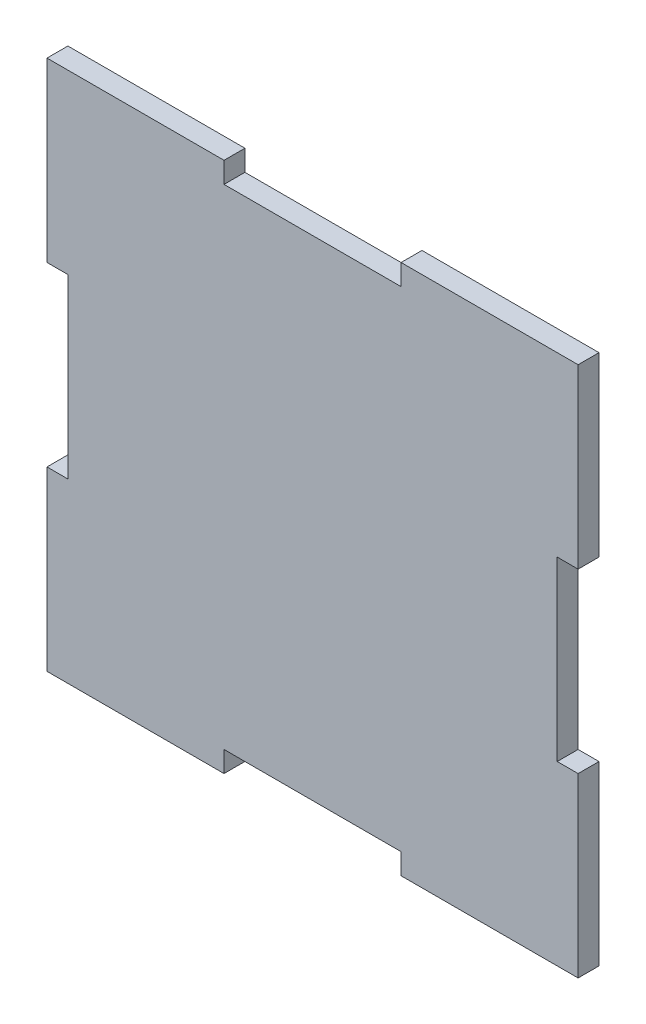
ISO-10303-21;
HEADER;
FILE_DESCRIPTION(('STEP AP214'),'2;1');
FILE_NAME('part.step','',(''),(''),'','','');
FILE_SCHEMA(('AUTOMOTIVE_DESIGN { 1 0 10303 214 1 1 1 1 }'));
ENDSEC;
DATA;
#1=APPLICATION_CONTEXT('core data for automotive mechanical design processes');
#2=APPLICATION_PROTOCOL_DEFINITION('international standard','automotive_design',2000,#1);
#3=PRODUCT_CONTEXT('',#1,'mechanical');
#4=PRODUCT('Part','Part','',(#3));
#5=PRODUCT_RELATED_PRODUCT_CATEGORY('part','',(#4));
#6=PRODUCT_DEFINITION_FORMATION('','',#4);
#7=PRODUCT_DEFINITION_CONTEXT('part definition',#1,'design');
#8=PRODUCT_DEFINITION('design','',#6,#7);
#9=PRODUCT_DEFINITION_SHAPE('','',#8);
#10=(LENGTH_UNIT() NAMED_UNIT(*) SI_UNIT(.MILLI.,.METRE.));
#11=(NAMED_UNIT(*) PLANE_ANGLE_UNIT() SI_UNIT($,.RADIAN.));
#12=(NAMED_UNIT(*) SI_UNIT($,.STERADIAN.) SOLID_ANGLE_UNIT());
#13=UNCERTAINTY_MEASURE_WITH_UNIT(LENGTH_MEASURE(1.E-05),#10,'distance_accuracy_value','');
#14=(GEOMETRIC_REPRESENTATION_CONTEXT(3) GLOBAL_UNCERTAINTY_ASSIGNED_CONTEXT((#13)) GLOBAL_UNIT_ASSIGNED_CONTEXT((#10,
#11,#12)) REPRESENTATION_CONTEXT('',''));
#15=CARTESIAN_POINT('',(0.,0.,0.));
#16=DIRECTION('',(0.,0.,1.));
#17=DIRECTION('',(1.,0.,0.));
#18=AXIS2_PLACEMENT_3D('',#15,#16,#17);
#19=CARTESIAN_POINT('',(0.,0.,2.9972));
#20=DIRECTION('',(1.,0.,0.));
#21=DIRECTION('',(0.,0.,-1.));
#22=AXIS2_PLACEMENT_3D('',#19,#20,#21);
#23=PLANE('',#22);
#24=DIRECTION('',(0.,-1.,0.));
#25=VECTOR('',#24,1.);
#26=CARTESIAN_POINT('',(0.,0.,0.));
#27=LINE('',#26,#25);
#28=CARTESIAN_POINT('',(0.,25.4,0.));
#29=VERTEX_POINT('',#28);
#30=CARTESIAN_POINT('',(0.,0.,0.));
#31=VERTEX_POINT('',#30);
#32=EDGE_CURVE('E201',#29,#31,#27,.T.);
#33=ORIENTED_EDGE('',*,*,#32,.T.);
#34=DIRECTION('',(0.,0.,-1.));
#35=VECTOR('',#34,1.);
#36=CARTESIAN_POINT('',(0.,0.,2.9972));
#37=LINE('',#36,#35);
#38=CARTESIAN_POINT('',(0.,0.,2.9972));
#39=VERTEX_POINT('',#38);
#40=EDGE_CURVE('E11',#39,#31,#37,.T.);
#41=ORIENTED_EDGE('',*,*,#40,.F.);
#42=DIRECTION('',(0.,-1.,0.));
#43=VECTOR('',#42,1.);
#44=CARTESIAN_POINT('',(0.,0.,2.9972));
#45=LINE('',#44,#43);
#46=CARTESIAN_POINT('',(0.,25.4,2.9972));
#47=VERTEX_POINT('',#46);
#48=EDGE_CURVE('E239',#47,#39,#45,.T.);
#49=ORIENTED_EDGE('',*,*,#48,.F.);
#50=DIRECTION('',(0.,0.,-1.));
#51=VECTOR('',#50,1.);
#52=CARTESIAN_POINT('',(0.,25.4,2.9972));
#53=LINE('',#52,#51);
#54=EDGE_CURVE('E197',#47,#29,#53,.T.);
#55=ORIENTED_EDGE('',*,*,#54,.T.);
#56=EDGE_LOOP('',(#33,#41,#49,#55));
#57=FACE_BOUND('',#56,.T.);
#58=ADVANCED_FACE('F33',(#57),#23,.F.);
#59=CARTESIAN_POINT('',(0.,0.,2.9972));
#60=DIRECTION('',(0.,1.,0.));
#61=DIRECTION('',(0.,0.,1.));
#62=AXIS2_PLACEMENT_3D('',#59,#60,#61);
#63=PLANE('',#62);
#64=DIRECTION('',(1.,0.,0.));
#65=VECTOR('',#64,1.);
#66=CARTESIAN_POINT('',(0.,0.,0.));
#67=LINE('',#66,#65);
#68=CARTESIAN_POINT('',(25.4,0.,0.));
#69=VERTEX_POINT('',#68);
#70=EDGE_CURVE('E204',#31,#69,#67,.T.);
#71=ORIENTED_EDGE('',*,*,#70,.T.);
#72=DIRECTION('',(0.,0.,-1.));
#73=VECTOR('',#72,1.);
#74=CARTESIAN_POINT('',(25.4,0.,2.9972));
#75=LINE('',#74,#73);
#76=CARTESIAN_POINT('',(25.4,0.,2.9972));
#77=VERTEX_POINT('',#76);
#78=EDGE_CURVE('E41',#77,#69,#75,.T.);
#79=ORIENTED_EDGE('',*,*,#78,.F.);
#80=DIRECTION('',(1.,0.,0.));
#81=VECTOR('',#80,1.);
#82=CARTESIAN_POINT('',(0.,0.,2.9972));
#83=LINE('',#82,#81);
#84=EDGE_CURVE('E128',#39,#77,#83,.T.);
#85=ORIENTED_EDGE('',*,*,#84,.F.);
#86=ORIENTED_EDGE('',*,*,#40,.T.);
#87=EDGE_LOOP('',(#71,#79,#85,#86));
#88=FACE_BOUND('',#87,.T.);
#89=ADVANCED_FACE('F357',(#88),#63,.F.);
#90=CARTESIAN_POINT('',(25.4,0.,2.9972));
#91=DIRECTION('',(-1.,0.,0.));
#92=DIRECTION('',(0.,0.,1.));
#93=AXIS2_PLACEMENT_3D('',#90,#91,#92);
#94=PLANE('',#93);
#95=DIRECTION('',(0.,1.,0.));
#96=VECTOR('',#95,1.);
#97=CARTESIAN_POINT('',(25.4,0.,0.));
#98=LINE('',#97,#96);
#99=CARTESIAN_POINT('',(25.4,2.9972,0.));
#100=VERTEX_POINT('',#99);
#101=EDGE_CURVE('E206',#69,#100,#98,.T.);
#102=ORIENTED_EDGE('',*,*,#101,.T.);
#103=DIRECTION('',(0.,0.,-1.));
#104=VECTOR('',#103,1.);
#105=CARTESIAN_POINT('',(25.4,2.9972,2.9972));
#106=LINE('',#105,#104);
#107=CARTESIAN_POINT('',(25.4,2.9972,2.9972));
#108=VERTEX_POINT('',#107);
#109=EDGE_CURVE('E282',#108,#100,#106,.T.);
#110=ORIENTED_EDGE('',*,*,#109,.F.);
#111=DIRECTION('',(0.,1.,0.));
#112=VECTOR('',#111,1.);
#113=CARTESIAN_POINT('',(25.4,0.,2.9972));
#114=LINE('',#113,#112);
#115=EDGE_CURVE('E290',#77,#108,#114,.T.);
#116=ORIENTED_EDGE('',*,*,#115,.F.);
#117=ORIENTED_EDGE('',*,*,#78,.T.);
#118=EDGE_LOOP('',(#102,#110,#116,#117));
#119=FACE_BOUND('',#118,.T.);
#120=ADVANCED_FACE('F288',(#119),#94,.F.);
#121=CARTESIAN_POINT('',(50.8,2.9972,2.9972));
#122=DIRECTION('',(0.,1.,0.));
#123=DIRECTION('',(-1.,0.,0.));
#124=AXIS2_PLACEMENT_3D('',#121,#122,#123);
#125=PLANE('',#124);
#126=DIRECTION('',(1.,0.,0.));
#127=VECTOR('',#126,1.);
#128=CARTESIAN_POINT('',(50.8,2.9972,0.));
#129=LINE('',#128,#127);
#130=CARTESIAN_POINT('',(50.8,2.9972,0.));
#131=VERTEX_POINT('',#130);
#132=EDGE_CURVE('E208',#100,#131,#129,.T.);
#133=ORIENTED_EDGE('',*,*,#132,.T.);
#134=DIRECTION('',(0.,0.,-1.));
#135=VECTOR('',#134,1.);
#136=CARTESIAN_POINT('',(50.8,2.9972,2.9972));
#137=LINE('',#136,#135);
#138=CARTESIAN_POINT('',(50.8,2.9972,2.9972));
#139=VERTEX_POINT('',#138);
#140=EDGE_CURVE('E279',#139,#131,#137,.T.);
#141=ORIENTED_EDGE('',*,*,#140,.F.);
#142=DIRECTION('',(1.,0.,0.));
#143=VECTOR('',#142,1.);
#144=CARTESIAN_POINT('',(50.8,2.9972,2.9972));
#145=LINE('',#144,#143);
#146=EDGE_CURVE('E308',#108,#139,#145,.T.);
#147=ORIENTED_EDGE('',*,*,#146,.F.);
#148=ORIENTED_EDGE('',*,*,#109,.T.);
#149=EDGE_LOOP('',(#133,#141,#147,#148));
#150=FACE_BOUND('',#149,.T.);
#151=ADVANCED_FACE('F299',(#150),#125,.F.);
#152=CARTESIAN_POINT('',(50.8,0.,2.9972));
#153=DIRECTION('',(1.,0.,0.));
#154=DIRECTION('',(0.,1.,0.));
#155=AXIS2_PLACEMENT_3D('',#152,#153,#154);
#156=PLANE('',#155);
#157=DIRECTION('',(0.,-1.,0.));
#158=VECTOR('',#157,1.);
#159=CARTESIAN_POINT('',(50.8,0.,0.));
#160=LINE('',#159,#158);
#161=CARTESIAN_POINT('',(50.8,0.,0.));
#162=VERTEX_POINT('',#161);
#163=EDGE_CURVE('E210',#131,#162,#160,.T.);
#164=ORIENTED_EDGE('',*,*,#163,.T.);
#165=DIRECTION('',(0.,0.,-1.));
#166=VECTOR('',#165,1.);
#167=CARTESIAN_POINT('',(50.8,0.,2.9972));
#168=LINE('',#167,#166);
#169=CARTESIAN_POINT('',(50.8,0.,2.9972));
#170=VERTEX_POINT('',#169);
#171=EDGE_CURVE('E276',#170,#162,#168,.T.);
#172=ORIENTED_EDGE('',*,*,#171,.F.);
#173=DIRECTION('',(0.,-1.,0.));
#174=VECTOR('',#173,1.);
#175=CARTESIAN_POINT('',(50.8,0.,2.9972));
#176=LINE('',#175,#174);
#177=EDGE_CURVE('E305',#139,#170,#176,.T.);
#178=ORIENTED_EDGE('',*,*,#177,.F.);
#179=ORIENTED_EDGE('',*,*,#140,.T.);
#180=EDGE_LOOP('',(#164,#172,#178,#179));
#181=FACE_BOUND('',#180,.T.);
#182=ADVANCED_FACE('F303',(#181),#156,.F.);
#183=CARTESIAN_POINT('',(50.8,0.,2.9972));
#184=DIRECTION('',(0.,1.,0.));
#185=DIRECTION('',(0.,0.,1.));
#186=AXIS2_PLACEMENT_3D('',#183,#184,#185);
#187=PLANE('',#186);
#188=DIRECTION('',(1.,0.,0.));
#189=VECTOR('',#188,1.);
#190=CARTESIAN_POINT('',(50.8,0.,0.));
#191=LINE('',#190,#189);
#192=CARTESIAN_POINT('',(76.2,0.,0.));
#193=VERTEX_POINT('',#192);
#194=EDGE_CURVE('E212',#162,#193,#191,.T.);
#195=ORIENTED_EDGE('',*,*,#194,.T.);
#196=DIRECTION('',(0.,0.,-1.));
#197=VECTOR('',#196,1.);
#198=CARTESIAN_POINT('',(76.2,0.,2.9972));
#199=LINE('',#198,#197);
#200=CARTESIAN_POINT('',(76.2,0.,2.9972));
#201=VERTEX_POINT('',#200);
#202=EDGE_CURVE('E273',#201,#193,#199,.T.);
#203=ORIENTED_EDGE('',*,*,#202,.F.);
#204=DIRECTION('',(1.,0.,0.));
#205=VECTOR('',#204,1.);
#206=CARTESIAN_POINT('',(50.8,0.,2.9972));
#207=LINE('',#206,#205);
#208=EDGE_CURVE('E307',#170,#201,#207,.T.);
#209=ORIENTED_EDGE('',*,*,#208,.F.);
#210=ORIENTED_EDGE('',*,*,#171,.T.);
#211=EDGE_LOOP('',(#195,#203,#209,#210));
#212=FACE_BOUND('',#211,.T.);
#213=ADVANCED_FACE('F370',(#212),#187,.F.);
#214=CARTESIAN_POINT('',(76.2,0.,2.9972));
#215=DIRECTION('',(-1.,0.,0.));
#216=DIRECTION('',(0.,-1.,0.));
#217=AXIS2_PLACEMENT_3D('',#214,#215,#216);
#218=PLANE('',#217);
#219=DIRECTION('',(0.,1.,0.));
#220=VECTOR('',#219,1.);
#221=CARTESIAN_POINT('',(76.2,0.,0.));
#222=LINE('',#221,#220);
#223=CARTESIAN_POINT('',(76.2,25.4,0.));
#224=VERTEX_POINT('',#223);
#225=EDGE_CURVE('E214',#193,#224,#222,.T.);
#226=ORIENTED_EDGE('',*,*,#225,.T.);
#227=DIRECTION('',(0.,0.,-1.));
#228=VECTOR('',#227,1.);
#229=CARTESIAN_POINT('',(76.2,25.4,2.9972));
#230=LINE('',#229,#228);
#231=CARTESIAN_POINT('',(76.2,25.4,2.9972));
#232=VERTEX_POINT('',#231);
#233=EDGE_CURVE('E270',#232,#224,#230,.T.);
#234=ORIENTED_EDGE('',*,*,#233,.F.);
#235=DIRECTION('',(0.,1.,0.));
#236=VECTOR('',#235,1.);
#237=CARTESIAN_POINT('',(76.2,0.,2.9972));
#238=LINE('',#237,#236);
#239=EDGE_CURVE('E310',#201,#232,#238,.T.);
#240=ORIENTED_EDGE('',*,*,#239,.F.);
#241=ORIENTED_EDGE('',*,*,#202,.T.);
#242=EDGE_LOOP('',(#226,#234,#240,#241));
#243=FACE_BOUND('',#242,.T.);
#244=ADVANCED_FACE('F373',(#243),#218,.F.);
#245=CARTESIAN_POINT('',(76.2,25.4,2.9972));
#246=DIRECTION('',(0.,-1.,0.));
#247=DIRECTION('',(1.,0.,0.));
#248=AXIS2_PLACEMENT_3D('',#245,#246,#247);
#249=PLANE('',#248);
#250=DIRECTION('',(-1.,0.,0.));
#251=VECTOR('',#250,1.);
#252=CARTESIAN_POINT('',(76.2,25.4,0.));
#253=LINE('',#252,#251);
#254=CARTESIAN_POINT('',(73.2028,25.4,0.));
#255=VERTEX_POINT('',#254);
#256=EDGE_CURVE('E216',#224,#255,#253,.T.);
#257=ORIENTED_EDGE('',*,*,#256,.T.);
#258=DIRECTION('',(0.,0.,-1.));
#259=VECTOR('',#258,1.);
#260=CARTESIAN_POINT('',(73.2028,25.4,2.9972));
#261=LINE('',#260,#259);
#262=CARTESIAN_POINT('',(73.2028,25.4,2.9972));
#263=VERTEX_POINT('',#262);
#264=EDGE_CURVE('E267',#263,#255,#261,.T.);
#265=ORIENTED_EDGE('',*,*,#264,.F.);
#266=DIRECTION('',(-1.,0.,0.));
#267=VECTOR('',#266,1.);
#268=CARTESIAN_POINT('',(76.2,25.4,2.9972));
#269=LINE('',#268,#267);
#270=EDGE_CURVE('E316',#232,#263,#269,.T.);
#271=ORIENTED_EDGE('',*,*,#270,.F.);
#272=ORIENTED_EDGE('',*,*,#233,.T.);
#273=EDGE_LOOP('',(#257,#265,#271,#272));
#274=FACE_BOUND('',#273,.T.);
#275=ADVANCED_FACE('F377',(#274),#249,.F.);
#276=CARTESIAN_POINT('',(73.2028,50.7999999999999,2.9972));
#277=DIRECTION('',(-1.,0.,0.));
#278=DIRECTION('',(0.,0.,1.));
#279=AXIS2_PLACEMENT_3D('',#276,#277,#278);
#280=PLANE('',#279);
#281=DIRECTION('',(0.,1.,0.));
#282=VECTOR('',#281,1.);
#283=CARTESIAN_POINT('',(73.2028,50.7999999999999,0.));
#284=LINE('',#283,#282);
#285=CARTESIAN_POINT('',(73.2028,50.7999999999999,0.));
#286=VERTEX_POINT('',#285);
#287=EDGE_CURVE('E218',#255,#286,#284,.T.);
#288=ORIENTED_EDGE('',*,*,#287,.T.);
#289=DIRECTION('',(0.,0.,-1.));
#290=VECTOR('',#289,1.);
#291=CARTESIAN_POINT('',(73.2028,50.7999999999999,2.9972));
#292=LINE('',#291,#290);
#293=CARTESIAN_POINT('',(73.2028,50.7999999999999,2.9972));
#294=VERTEX_POINT('',#293);
#295=EDGE_CURVE('E264',#294,#286,#292,.T.);
#296=ORIENTED_EDGE('',*,*,#295,.F.);
#297=DIRECTION('',(0.,1.,0.));
#298=VECTOR('',#297,1.);
#299=CARTESIAN_POINT('',(73.2028,50.7999999999999,2.9972));
#300=LINE('',#299,#298);
#301=EDGE_CURVE('E318',#263,#294,#300,.T.);
#302=ORIENTED_EDGE('',*,*,#301,.F.);
#303=ORIENTED_EDGE('',*,*,#264,.T.);
#304=EDGE_LOOP('',(#288,#296,#302,#303));
#305=FACE_BOUND('',#304,.T.);
#306=ADVANCED_FACE('F381',(#305),#280,.F.);
#307=CARTESIAN_POINT('',(76.2,50.7999999999999,2.9972));
#308=DIRECTION('',(0.,1.,0.));
#309=DIRECTION('',(0.,0.,1.));
#310=AXIS2_PLACEMENT_3D('',#307,#308,#309);
#311=PLANE('',#310);
#312=DIRECTION('',(1.,0.,0.));
#313=VECTOR('',#312,1.);
#314=CARTESIAN_POINT('',(76.2,50.7999999999999,0.));
#315=LINE('',#314,#313);
#316=CARTESIAN_POINT('',(76.2,50.7999999999999,0.));
#317=VERTEX_POINT('',#316);
#318=EDGE_CURVE('E220',#286,#317,#315,.T.);
#319=ORIENTED_EDGE('',*,*,#318,.T.);
#320=DIRECTION('',(0.,0.,-1.));
#321=VECTOR('',#320,1.);
#322=CARTESIAN_POINT('',(76.2,50.7999999999999,2.9972));
#323=LINE('',#322,#321);
#324=CARTESIAN_POINT('',(76.2,50.7999999999999,2.9972));
#325=VERTEX_POINT('',#324);
#326=EDGE_CURVE('E261',#325,#317,#323,.T.);
#327=ORIENTED_EDGE('',*,*,#326,.F.);
#328=DIRECTION('',(1.,0.,0.));
#329=VECTOR('',#328,1.);
#330=CARTESIAN_POINT('',(76.2,50.7999999999999,2.9972));
#331=LINE('',#330,#329);
#332=EDGE_CURVE('E320',#294,#325,#331,.T.);
#333=ORIENTED_EDGE('',*,*,#332,.F.);
#334=ORIENTED_EDGE('',*,*,#295,.T.);
#335=EDGE_LOOP('',(#319,#327,#333,#334));
#336=FACE_BOUND('',#335,.T.);
#337=ADVANCED_FACE('F385',(#336),#311,.F.);
#338=CARTESIAN_POINT('',(76.2,50.7999999999999,2.9972));
#339=DIRECTION('',(-1.,0.,0.));
#340=DIRECTION('',(0.,0.,1.));
#341=AXIS2_PLACEMENT_3D('',#338,#339,#340);
#342=PLANE('',#341);
#343=DIRECTION('',(0.,1.,0.));
#344=VECTOR('',#343,1.);
#345=CARTESIAN_POINT('',(76.2,50.7999999999999,0.));
#346=LINE('',#345,#344);
#347=CARTESIAN_POINT('',(76.2,76.2,0.));
#348=VERTEX_POINT('',#347);
#349=EDGE_CURVE('E222',#317,#348,#346,.T.);
#350=ORIENTED_EDGE('',*,*,#349,.T.);
#351=DIRECTION('',(0.,0.,-1.));
#352=VECTOR('',#351,1.);
#353=CARTESIAN_POINT('',(76.2,76.2,2.9972));
#354=LINE('',#353,#352);
#355=CARTESIAN_POINT('',(76.2,76.2,2.9972));
#356=VERTEX_POINT('',#355);
#357=EDGE_CURVE('E258',#356,#348,#354,.T.);
#358=ORIENTED_EDGE('',*,*,#357,.F.);
#359=DIRECTION('',(0.,1.,0.));
#360=VECTOR('',#359,1.);
#361=CARTESIAN_POINT('',(76.2,50.7999999999999,2.9972));
#362=LINE('',#361,#360);
#363=EDGE_CURVE('E322',#325,#356,#362,.T.);
#364=ORIENTED_EDGE('',*,*,#363,.F.);
#365=ORIENTED_EDGE('',*,*,#326,.T.);
#366=EDGE_LOOP('',(#350,#358,#364,#365));
#367=FACE_BOUND('',#366,.T.);
#368=ADVANCED_FACE('F389',(#367),#342,.F.);
#369=CARTESIAN_POINT('',(50.8,76.2,2.9972));
#370=DIRECTION('',(0.,-1.,0.));
#371=DIRECTION('',(0.,0.,-1.));
#372=AXIS2_PLACEMENT_3D('',#369,#370,#371);
#373=PLANE('',#372);
#374=DIRECTION('',(-1.,0.,0.));
#375=VECTOR('',#374,1.);
#376=CARTESIAN_POINT('',(50.8,76.2,0.));
#377=LINE('',#376,#375);
#378=CARTESIAN_POINT('',(50.8,76.2,0.));
#379=VERTEX_POINT('',#378);
#380=EDGE_CURVE('E224',#348,#379,#377,.T.);
#381=ORIENTED_EDGE('',*,*,#380,.T.);
#382=DIRECTION('',(0.,0.,-1.));
#383=VECTOR('',#382,1.);
#384=CARTESIAN_POINT('',(50.8,76.2,2.9972));
#385=LINE('',#384,#383);
#386=CARTESIAN_POINT('',(50.8,76.2,2.9972));
#387=VERTEX_POINT('',#386);
#388=EDGE_CURVE('E255',#387,#379,#385,.T.);
#389=ORIENTED_EDGE('',*,*,#388,.F.);
#390=DIRECTION('',(-1.,0.,0.));
#391=VECTOR('',#390,1.);
#392=CARTESIAN_POINT('',(50.8,76.2,2.9972));
#393=LINE('',#392,#391);
#394=EDGE_CURVE('E324',#356,#387,#393,.T.);
#395=ORIENTED_EDGE('',*,*,#394,.F.);
#396=ORIENTED_EDGE('',*,*,#357,.T.);
#397=EDGE_LOOP('',(#381,#389,#395,#396));
#398=FACE_BOUND('',#397,.T.);
#399=ADVANCED_FACE('F393',(#398),#373,.F.);
#400=CARTESIAN_POINT('',(50.8,76.2,2.9972));
#401=DIRECTION('',(1.,0.,0.));
#402=DIRECTION('',(0.,1.,0.));
#403=AXIS2_PLACEMENT_3D('',#400,#401,#402);
#404=PLANE('',#403);
#405=DIRECTION('',(0.,-1.,0.));
#406=VECTOR('',#405,1.);
#407=CARTESIAN_POINT('',(50.8,76.2,0.));
#408=LINE('',#407,#406);
#409=CARTESIAN_POINT('',(50.8,73.2028,0.));
#410=VERTEX_POINT('',#409);
#411=EDGE_CURVE('E226',#379,#410,#408,.T.);
#412=ORIENTED_EDGE('',*,*,#411,.T.);
#413=DIRECTION('',(0.,0.,-1.));
#414=VECTOR('',#413,1.);
#415=CARTESIAN_POINT('',(50.8,73.2028,2.9972));
#416=LINE('',#415,#414);
#417=CARTESIAN_POINT('',(50.8,73.2028,2.9972));
#418=VERTEX_POINT('',#417);
#419=EDGE_CURVE('E252',#418,#410,#416,.T.);
#420=ORIENTED_EDGE('',*,*,#419,.F.);
#421=DIRECTION('',(0.,-1.,0.));
#422=VECTOR('',#421,1.);
#423=CARTESIAN_POINT('',(50.8,76.2,2.9972));
#424=LINE('',#423,#422);
#425=EDGE_CURVE('E326',#387,#418,#424,.T.);
#426=ORIENTED_EDGE('',*,*,#425,.F.);
#427=ORIENTED_EDGE('',*,*,#388,.T.);
#428=EDGE_LOOP('',(#412,#420,#426,#427));
#429=FACE_BOUND('',#428,.T.);
#430=ADVANCED_FACE('F397',(#429),#404,.F.);
#431=CARTESIAN_POINT('',(25.4,73.2028,2.9972));
#432=DIRECTION('',(0.,-1.,0.));
#433=DIRECTION('',(0.,0.,-1.));
#434=AXIS2_PLACEMENT_3D('',#431,#432,#433);
#435=PLANE('',#434);
#436=DIRECTION('',(-1.,0.,0.));
#437=VECTOR('',#436,1.);
#438=CARTESIAN_POINT('',(25.4,73.2028,0.));
#439=LINE('',#438,#437);
#440=CARTESIAN_POINT('',(25.4,73.2028,0.));
#441=VERTEX_POINT('',#440);
#442=EDGE_CURVE('E228',#410,#441,#439,.T.);
#443=ORIENTED_EDGE('',*,*,#442,.T.);
#444=DIRECTION('',(0.,0.,-1.));
#445=VECTOR('',#444,1.);
#446=CARTESIAN_POINT('',(25.4,73.2028,2.9972));
#447=LINE('',#446,#445);
#448=CARTESIAN_POINT('',(25.4,73.2028,2.9972));
#449=VERTEX_POINT('',#448);
#450=EDGE_CURVE('E249',#449,#441,#447,.T.);
#451=ORIENTED_EDGE('',*,*,#450,.F.);
#452=DIRECTION('',(-1.,0.,0.));
#453=VECTOR('',#452,1.);
#454=CARTESIAN_POINT('',(25.4,73.2028,2.9972));
#455=LINE('',#454,#453);
#456=EDGE_CURVE('E328',#418,#449,#455,.T.);
#457=ORIENTED_EDGE('',*,*,#456,.F.);
#458=ORIENTED_EDGE('',*,*,#419,.T.);
#459=EDGE_LOOP('',(#443,#451,#457,#458));
#460=FACE_BOUND('',#459,.T.);
#461=ADVANCED_FACE('F401',(#460),#435,.F.);
#462=CARTESIAN_POINT('',(25.4,76.2,2.9972));
#463=DIRECTION('',(-1.,0.,0.));
#464=DIRECTION('',(0.,-1.,0.));
#465=AXIS2_PLACEMENT_3D('',#462,#463,#464);
#466=PLANE('',#465);
#467=DIRECTION('',(0.,1.,0.));
#468=VECTOR('',#467,1.);
#469=CARTESIAN_POINT('',(25.4,76.2,0.));
#470=LINE('',#469,#468);
#471=CARTESIAN_POINT('',(25.4,76.2,0.));
#472=VERTEX_POINT('',#471);
#473=EDGE_CURVE('E230',#441,#472,#470,.T.);
#474=ORIENTED_EDGE('',*,*,#473,.T.);
#475=DIRECTION('',(0.,0.,-1.));
#476=VECTOR('',#475,1.);
#477=CARTESIAN_POINT('',(25.4,76.2,2.9972));
#478=LINE('',#477,#476);
#479=CARTESIAN_POINT('',(25.4,76.2,2.9972));
#480=VERTEX_POINT('',#479);
#481=EDGE_CURVE('E246',#480,#472,#478,.T.);
#482=ORIENTED_EDGE('',*,*,#481,.F.);
#483=DIRECTION('',(0.,1.,0.));
#484=VECTOR('',#483,1.);
#485=CARTESIAN_POINT('',(25.4,76.2,2.9972));
#486=LINE('',#485,#484);
#487=EDGE_CURVE('E330',#449,#480,#486,.T.);
#488=ORIENTED_EDGE('',*,*,#487,.F.);
#489=ORIENTED_EDGE('',*,*,#450,.T.);
#490=EDGE_LOOP('',(#474,#482,#488,#489));
#491=FACE_BOUND('',#490,.T.);
#492=ADVANCED_FACE('F405',(#491),#466,.F.);
#493=CARTESIAN_POINT('',(0.,76.2,2.9972));
#494=DIRECTION('',(0.,-1.,0.));
#495=DIRECTION('',(0.,0.,-1.));
#496=AXIS2_PLACEMENT_3D('',#493,#494,#495);
#497=PLANE('',#496);
#498=DIRECTION('',(-1.,0.,0.));
#499=VECTOR('',#498,1.);
#500=CARTESIAN_POINT('',(0.,76.2,0.));
#501=LINE('',#500,#499);
#502=CARTESIAN_POINT('',(0.,76.2,0.));
#503=VERTEX_POINT('',#502);
#504=EDGE_CURVE('E232',#472,#503,#501,.T.);
#505=ORIENTED_EDGE('',*,*,#504,.T.);
#506=DIRECTION('',(0.,0.,-1.));
#507=VECTOR('',#506,1.);
#508=CARTESIAN_POINT('',(0.,76.2,2.9972));
#509=LINE('',#508,#507);
#510=CARTESIAN_POINT('',(0.,76.2,2.9972));
#511=VERTEX_POINT('',#510);
#512=EDGE_CURVE('E243',#511,#503,#509,.T.);
#513=ORIENTED_EDGE('',*,*,#512,.F.);
#514=DIRECTION('',(-1.,0.,0.));
#515=VECTOR('',#514,1.);
#516=CARTESIAN_POINT('',(0.,76.2,2.9972));
#517=LINE('',#516,#515);
#518=EDGE_CURVE('E332',#480,#511,#517,.T.);
#519=ORIENTED_EDGE('',*,*,#518,.F.);
#520=ORIENTED_EDGE('',*,*,#481,.T.);
#521=EDGE_LOOP('',(#505,#513,#519,#520));
#522=FACE_BOUND('',#521,.T.);
#523=ADVANCED_FACE('F338',(#522),#497,.F.);
#524=CARTESIAN_POINT('',(0.,50.7999999999999,2.9972));
#525=DIRECTION('',(1.,0.,0.));
#526=DIRECTION('',(0.,1.,0.));
#527=AXIS2_PLACEMENT_3D('',#524,#525,#526);
#528=PLANE('',#527);
#529=DIRECTION('',(0.,-1.,0.));
#530=VECTOR('',#529,1.);
#531=CARTESIAN_POINT('',(0.,50.7999999999999,0.));
#532=LINE('',#531,#530);
#533=CARTESIAN_POINT('',(0.,50.7999999999999,0.));
#534=VERTEX_POINT('',#533);
#535=EDGE_CURVE('E234',#503,#534,#532,.T.);
#536=ORIENTED_EDGE('',*,*,#535,.T.);
#537=DIRECTION('',(0.,0.,-1.));
#538=VECTOR('',#537,1.);
#539=CARTESIAN_POINT('',(0.,50.7999999999999,2.9972));
#540=LINE('',#539,#538);
#541=CARTESIAN_POINT('',(0.,50.7999999999999,2.9972));
#542=VERTEX_POINT('',#541);
#543=EDGE_CURVE('E192',#542,#534,#540,.T.);
#544=ORIENTED_EDGE('',*,*,#543,.F.);
#545=DIRECTION('',(0.,-1.,0.));
#546=VECTOR('',#545,1.);
#547=CARTESIAN_POINT('',(0.,50.7999999999999,2.9972));
#548=LINE('',#547,#546);
#549=EDGE_CURVE('E183',#511,#542,#548,.T.);
#550=ORIENTED_EDGE('',*,*,#549,.F.);
#551=ORIENTED_EDGE('',*,*,#512,.T.);
#552=EDGE_LOOP('',(#536,#544,#550,#551));
#553=FACE_BOUND('',#552,.T.);
#554=ADVANCED_FACE('F342',(#553),#528,.F.);
#555=CARTESIAN_POINT('',(0.,50.7999999999999,2.9972));
#556=DIRECTION('',(0.,1.,0.));
#557=DIRECTION('',(0.,0.,1.));
#558=AXIS2_PLACEMENT_3D('',#555,#556,#557);
#559=PLANE('',#558);
#560=DIRECTION('',(1.,0.,0.));
#561=VECTOR('',#560,1.);
#562=CARTESIAN_POINT('',(0.,50.7999999999999,0.));
#563=LINE('',#562,#561);
#564=CARTESIAN_POINT('',(2.9972,50.7999999999999,0.));
#565=VERTEX_POINT('',#564);
#566=EDGE_CURVE('E191',#534,#565,#563,.T.);
#567=ORIENTED_EDGE('',*,*,#566,.T.);
#568=DIRECTION('',(0.,0.,-1.));
#569=VECTOR('',#568,1.);
#570=CARTESIAN_POINT('',(2.9972,50.7999999999999,2.9972));
#571=LINE('',#570,#569);
#572=CARTESIAN_POINT('',(2.9972,50.7999999999999,2.9972));
#573=VERTEX_POINT('',#572);
#574=EDGE_CURVE('E188',#573,#565,#571,.T.);
#575=ORIENTED_EDGE('',*,*,#574,.F.);
#576=DIRECTION('',(1.,0.,0.));
#577=VECTOR('',#576,1.);
#578=CARTESIAN_POINT('',(0.,50.7999999999999,2.9972));
#579=LINE('',#578,#577);
#580=EDGE_CURVE('E177',#542,#573,#579,.T.);
#581=ORIENTED_EDGE('',*,*,#580,.F.);
#582=ORIENTED_EDGE('',*,*,#543,.T.);
#583=EDGE_LOOP('',(#567,#575,#581,#582));
#584=FACE_BOUND('',#583,.T.);
#585=ADVANCED_FACE('F189',(#584),#559,.F.);
#586=CARTESIAN_POINT('',(2.9972,50.7999999999999,2.9972));
#587=DIRECTION('',(1.,0.,0.));
#588=DIRECTION('',(0.,1.,0.));
#589=AXIS2_PLACEMENT_3D('',#586,#587,#588);
#590=PLANE('',#589);
#591=DIRECTION('',(0.,-1.,0.));
#592=VECTOR('',#591,1.);
#593=CARTESIAN_POINT('',(2.9972,50.7999999999999,0.));
#594=LINE('',#593,#592);
#595=CARTESIAN_POINT('',(2.9972,25.4,0.));
#596=VERTEX_POINT('',#595);
#597=EDGE_CURVE('E114',#565,#596,#594,.T.);
#598=ORIENTED_EDGE('',*,*,#597,.T.);
#599=DIRECTION('',(0.,0.,-1.));
#600=VECTOR('',#599,1.);
#601=CARTESIAN_POINT('',(2.9972,25.4,2.9972));
#602=LINE('',#601,#600);
#603=CARTESIAN_POINT('',(2.9972,25.4,2.9972));
#604=VERTEX_POINT('',#603);
#605=EDGE_CURVE('E193',#604,#596,#602,.T.);
#606=ORIENTED_EDGE('',*,*,#605,.F.);
#607=DIRECTION('',(0.,-1.,0.));
#608=VECTOR('',#607,1.);
#609=CARTESIAN_POINT('',(2.9972,50.7999999999999,2.9972));
#610=LINE('',#609,#608);
#611=EDGE_CURVE('E181',#573,#604,#610,.T.);
#612=ORIENTED_EDGE('',*,*,#611,.F.);
#613=ORIENTED_EDGE('',*,*,#574,.T.);
#614=EDGE_LOOP('',(#598,#606,#612,#613));
#615=FACE_BOUND('',#614,.T.);
#616=ADVANCED_FACE('F195',(#615),#590,.F.);
#617=CARTESIAN_POINT('',(0.,25.4,2.9972));
#618=DIRECTION('',(0.,-1.,0.));
#619=DIRECTION('',(1.,0.,0.));
#620=AXIS2_PLACEMENT_3D('',#617,#618,#619);
#621=PLANE('',#620);
#622=DIRECTION('',(-1.,0.,0.));
#623=VECTOR('',#622,1.);
#624=CARTESIAN_POINT('',(0.,25.4,0.));
#625=LINE('',#624,#623);
#626=EDGE_CURVE('E120',#596,#29,#625,.T.);
#627=ORIENTED_EDGE('',*,*,#626,.T.);
#628=ORIENTED_EDGE('',*,*,#54,.F.);
#629=DIRECTION('',(-1.,0.,0.));
#630=VECTOR('',#629,1.);
#631=CARTESIAN_POINT('',(0.,25.4,2.9972));
#632=LINE('',#631,#630);
#633=EDGE_CURVE('E49',#604,#47,#632,.T.);
#634=ORIENTED_EDGE('',*,*,#633,.F.);
#635=ORIENTED_EDGE('',*,*,#605,.T.);
#636=EDGE_LOOP('',(#627,#628,#634,#635));
#637=FACE_BOUND('',#636,.T.);
#638=ADVANCED_FACE('F346',(#637),#621,.F.);
#639=CARTESIAN_POINT('',(0.,25.4,2.9972));
#640=DIRECTION('',(0.,0.,-1.));
#641=DIRECTION('',(-1.,0.,0.));
#642=AXIS2_PLACEMENT_3D('',#639,#640,#641);
#643=PLANE('',#642);
#644=ORIENTED_EDGE('',*,*,#48,.T.);
#645=ORIENTED_EDGE('',*,*,#84,.T.);
#646=ORIENTED_EDGE('',*,*,#115,.T.);
#647=ORIENTED_EDGE('',*,*,#146,.T.);
#648=ORIENTED_EDGE('',*,*,#177,.T.);
#649=ORIENTED_EDGE('',*,*,#208,.T.);
#650=ORIENTED_EDGE('',*,*,#239,.T.);
#651=ORIENTED_EDGE('',*,*,#270,.T.);
#652=ORIENTED_EDGE('',*,*,#301,.T.);
#653=ORIENTED_EDGE('',*,*,#332,.T.);
#654=ORIENTED_EDGE('',*,*,#363,.T.);
#655=ORIENTED_EDGE('',*,*,#394,.T.);
#656=ORIENTED_EDGE('',*,*,#425,.T.);
#657=ORIENTED_EDGE('',*,*,#456,.T.);
#658=ORIENTED_EDGE('',*,*,#487,.T.);
#659=ORIENTED_EDGE('',*,*,#518,.T.);
#660=ORIENTED_EDGE('',*,*,#549,.T.);
#661=ORIENTED_EDGE('',*,*,#580,.T.);
#662=ORIENTED_EDGE('',*,*,#611,.T.);
#663=ORIENTED_EDGE('',*,*,#633,.T.);
#664=EDGE_LOOP('',(#644,#645,#646,#647,#648,#649,#650,#651,#652,#653,#654,#655,#656,#657,#658,
#659,#660,#661,#662,#663));
#665=FACE_BOUND('',#664,.T.);
#666=ADVANCED_FACE('F179',(#665),#643,.F.);
#667=CARTESIAN_POINT('',(0.,25.4,0.));
#668=DIRECTION('',(0.,0.,-1.));
#669=DIRECTION('',(-1.,0.,0.));
#670=AXIS2_PLACEMENT_3D('',#667,#668,#669);
#671=PLANE('',#670);
#672=ORIENTED_EDGE('',*,*,#32,.F.);
#673=ORIENTED_EDGE('',*,*,#626,.F.);
#674=ORIENTED_EDGE('',*,*,#597,.F.);
#675=ORIENTED_EDGE('',*,*,#566,.F.);
#676=ORIENTED_EDGE('',*,*,#535,.F.);
#677=ORIENTED_EDGE('',*,*,#504,.F.);
#678=ORIENTED_EDGE('',*,*,#473,.F.);
#679=ORIENTED_EDGE('',*,*,#442,.F.);
#680=ORIENTED_EDGE('',*,*,#411,.F.);
#681=ORIENTED_EDGE('',*,*,#380,.F.);
#682=ORIENTED_EDGE('',*,*,#349,.F.);
#683=ORIENTED_EDGE('',*,*,#318,.F.);
#684=ORIENTED_EDGE('',*,*,#287,.F.);
#685=ORIENTED_EDGE('',*,*,#256,.F.);
#686=ORIENTED_EDGE('',*,*,#225,.F.);
#687=ORIENTED_EDGE('',*,*,#194,.F.);
#688=ORIENTED_EDGE('',*,*,#163,.F.);
#689=ORIENTED_EDGE('',*,*,#132,.F.);
#690=ORIENTED_EDGE('',*,*,#101,.F.);
#691=ORIENTED_EDGE('',*,*,#70,.F.);
#692=EDGE_LOOP('',(#672,#673,#674,#675,#676,#677,#678,#679,#680,#681,#682,#683,#684,#685,#686,
#687,#688,#689,#690,#691));
#693=FACE_BOUND('',#692,.T.);
#694=ADVANCED_FACE('F294',(#693),#671,.T.);
#695=CLOSED_SHELL('',(#58,#89,#120,#151,#182,#213,#244,#275,#306,#337,#368,#399,#430,#461,#492,
#523,#554,#585,#616,#638,#666,#694));
#696=MANIFOLD_SOLID_BREP('B2',#695);
#697=ADVANCED_BREP_SHAPE_REPRESENTATION('',(#18,#696),#14);
#698=SHAPE_DEFINITION_REPRESENTATION(#9,#697);
ENDSEC;
END-ISO-10303-21;
